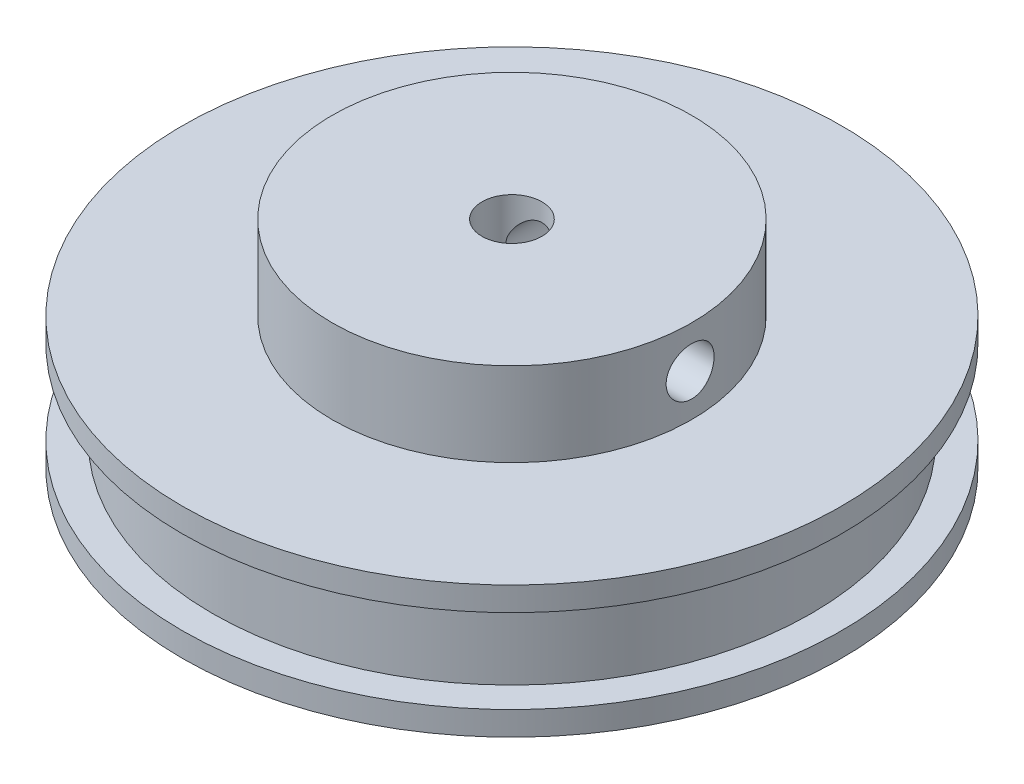
ISO-10303-21;
HEADER;
FILE_DESCRIPTION(('STEP AP214'),'2;1');
FILE_NAME('part.step','',(''),(''),'','','');
FILE_SCHEMA(('AUTOMOTIVE_DESIGN { 1 0 10303 214 1 1 1 1 }'));
ENDSEC;
DATA;
#1=APPLICATION_CONTEXT('core data for automotive mechanical design processes');
#2=APPLICATION_PROTOCOL_DEFINITION('international standard','automotive_design',2000,#1);
#3=PRODUCT_CONTEXT('',#1,'mechanical');
#4=PRODUCT('Part','Part','',(#3));
#5=PRODUCT_RELATED_PRODUCT_CATEGORY('part','',(#4));
#6=PRODUCT_DEFINITION_FORMATION('','',#4);
#7=PRODUCT_DEFINITION_CONTEXT('part definition',#1,'design');
#8=PRODUCT_DEFINITION('design','',#6,#7);
#9=PRODUCT_DEFINITION_SHAPE('','',#8);
#10=(LENGTH_UNIT() NAMED_UNIT(*) SI_UNIT(.MILLI.,.METRE.));
#11=(NAMED_UNIT(*) PLANE_ANGLE_UNIT() SI_UNIT($,.RADIAN.));
#12=(NAMED_UNIT(*) SI_UNIT($,.STERADIAN.) SOLID_ANGLE_UNIT());
#13=UNCERTAINTY_MEASURE_WITH_UNIT(LENGTH_MEASURE(1.E-05),#10,'distance_accuracy_value','');
#14=(GEOMETRIC_REPRESENTATION_CONTEXT(3) GLOBAL_UNCERTAINTY_ASSIGNED_CONTEXT((#13)) GLOBAL_UNIT_ASSIGNED_CONTEXT((#10,
#11,#12)) REPRESENTATION_CONTEXT('',''));
#15=CARTESIAN_POINT('',(0.,0.,0.));
#16=DIRECTION('',(0.,0.,1.));
#17=DIRECTION('',(1.,0.,0.));
#18=AXIS2_PLACEMENT_3D('',#15,#16,#17);
#19=CARTESIAN_POINT('',(0.,2.,0.));
#20=DIRECTION('',(0.,-1.,0.));
#21=DIRECTION('',(0.,0.,-1.));
#22=AXIS2_PLACEMENT_3D('',#19,#20,#21);
#23=CYLINDRICAL_SURFACE('',#22,27.5);
#24=CARTESIAN_POINT('',(0.,2.,0.));
#25=DIRECTION('',(0.,1.,0.));
#26=DIRECTION('',(0.,0.,1.));
#27=AXIS2_PLACEMENT_3D('',#24,#25,#26);
#28=CIRCLE('',#27,27.5);
#29=CARTESIAN_POINT('',(0.,2.,27.5));
#30=VERTEX_POINT('',#29);
#31=EDGE_CURVE('E135',#30,#30,#28,.T.);
#32=ORIENTED_EDGE('',*,*,#31,.F.);
#33=EDGE_LOOP('',(#32));
#34=FACE_BOUND('',#33,.T.);
#35=CARTESIAN_POINT('',(0.,0.,0.));
#36=DIRECTION('',(0.,1.,0.));
#37=DIRECTION('',(0.,0.,1.));
#38=AXIS2_PLACEMENT_3D('',#35,#36,#37);
#39=CIRCLE('',#38,27.5);
#40=CARTESIAN_POINT('',(0.,0.,27.5));
#41=VERTEX_POINT('',#40);
#42=EDGE_CURVE('E76',#41,#41,#39,.T.);
#43=ORIENTED_EDGE('',*,*,#42,.T.);
#44=EDGE_LOOP('',(#43));
#45=FACE_BOUND('',#44,.T.);
#46=ADVANCED_FACE('F37',(#34,#45),#23,.T.);
#47=CARTESIAN_POINT('',(0.,2.,0.));
#48=DIRECTION('',(0.,1.,0.));
#49=DIRECTION('',(0.,0.,1.));
#50=AXIS2_PLACEMENT_3D('',#47,#48,#49);
#51=PLANE('',#50);
#52=CARTESIAN_POINT('',(0.,2.,0.));
#53=DIRECTION('',(0.,1.,0.));
#54=DIRECTION('',(0.,0.,1.));
#55=AXIS2_PLACEMENT_3D('',#52,#53,#54);
#56=CIRCLE('',#55,25.);
#57=CARTESIAN_POINT('',(0.,2.,25.));
#58=VERTEX_POINT('',#57);
#59=EDGE_CURVE('E139',#58,#58,#56,.T.);
#60=ORIENTED_EDGE('',*,*,#59,.F.);
#61=EDGE_LOOP('',(#60));
#62=FACE_BOUND('',#61,.T.);
#63=ORIENTED_EDGE('',*,*,#31,.T.);
#64=EDGE_LOOP('',(#63));
#65=FACE_BOUND('',#64,.T.);
#66=ADVANCED_FACE('F119',(#62,#65),#51,.T.);
#67=CARTESIAN_POINT('',(0.,0.,0.));
#68=DIRECTION('',(0.,1.,0.));
#69=DIRECTION('',(0.,0.,1.));
#70=AXIS2_PLACEMENT_3D('',#67,#68,#69);
#71=PLANE('',#70);
#72=CARTESIAN_POINT('',(0.,0.,0.));
#73=DIRECTION('',(0.,1.,0.));
#74=DIRECTION('',(0.,0.,1.));
#75=AXIS2_PLACEMENT_3D('',#72,#73,#74);
#76=CIRCLE('',#75,2.5);
#77=CARTESIAN_POINT('',(0.,0.,2.5));
#78=VERTEX_POINT('',#77);
#79=EDGE_CURVE('E93',#78,#78,#76,.T.);
#80=ORIENTED_EDGE('',*,*,#79,.T.);
#81=EDGE_LOOP('',(#80));
#82=FACE_BOUND('',#81,.T.);
#83=ORIENTED_EDGE('',*,*,#42,.F.);
#84=EDGE_LOOP('',(#83));
#85=FACE_BOUND('',#84,.T.);
#86=ADVANCED_FACE('F117',(#82,#85),#71,.F.);
#87=CARTESIAN_POINT('',(0.,9.,0.));
#88=DIRECTION('',(0.,-1.,0.));
#89=DIRECTION('',(0.,0.,-1.));
#90=AXIS2_PLACEMENT_3D('',#87,#88,#89);
#91=CYLINDRICAL_SURFACE('',#90,25.);
#92=CARTESIAN_POINT('',(0.,9.,0.));
#93=DIRECTION('',(0.,1.,0.));
#94=DIRECTION('',(0.,0.,1.));
#95=AXIS2_PLACEMENT_3D('',#92,#93,#94);
#96=CIRCLE('',#95,25.);
#97=CARTESIAN_POINT('',(0.,9.,25.));
#98=VERTEX_POINT('',#97);
#99=EDGE_CURVE('E138',#98,#98,#96,.T.);
#100=ORIENTED_EDGE('',*,*,#99,.F.);
#101=EDGE_LOOP('',(#100));
#102=FACE_BOUND('',#101,.T.);
#103=ORIENTED_EDGE('',*,*,#59,.T.);
#104=EDGE_LOOP('',(#103));
#105=FACE_BOUND('',#104,.T.);
#106=ADVANCED_FACE('F113',(#102,#105),#91,.T.);
#107=CARTESIAN_POINT('',(0.,11.,0.));
#108=DIRECTION('',(0.,-1.,0.));
#109=DIRECTION('',(0.,0.,-1.));
#110=AXIS2_PLACEMENT_3D('',#107,#108,#109);
#111=CYLINDRICAL_SURFACE('',#110,27.5);
#112=CARTESIAN_POINT('',(0.,11.,0.));
#113=DIRECTION('',(0.,1.,0.));
#114=DIRECTION('',(0.,0.,1.));
#115=AXIS2_PLACEMENT_3D('',#112,#113,#114);
#116=CIRCLE('',#115,27.5);
#117=CARTESIAN_POINT('',(0.,11.,27.5));
#118=VERTEX_POINT('',#117);
#119=EDGE_CURVE('E141',#118,#118,#116,.T.);
#120=ORIENTED_EDGE('',*,*,#119,.F.);
#121=EDGE_LOOP('',(#120));
#122=FACE_BOUND('',#121,.T.);
#123=CARTESIAN_POINT('',(0.,9.,0.));
#124=DIRECTION('',(0.,1.,0.));
#125=DIRECTION('',(0.,0.,1.));
#126=AXIS2_PLACEMENT_3D('',#123,#124,#125);
#127=CIRCLE('',#126,27.5);
#128=CARTESIAN_POINT('',(0.,9.,27.5));
#129=VERTEX_POINT('',#128);
#130=EDGE_CURVE('E145',#129,#129,#127,.T.);
#131=ORIENTED_EDGE('',*,*,#130,.T.);
#132=EDGE_LOOP('',(#131));
#133=FACE_BOUND('',#132,.T.);
#134=ADVANCED_FACE('F106',(#122,#133),#111,.T.);
#135=CARTESIAN_POINT('',(0.,11.,0.));
#136=DIRECTION('',(0.,1.,0.));
#137=DIRECTION('',(0.,0.,1.));
#138=AXIS2_PLACEMENT_3D('',#135,#136,#137);
#139=PLANE('',#138);
#140=CARTESIAN_POINT('',(0.,11.,0.));
#141=DIRECTION('',(0.,1.,0.));
#142=DIRECTION('',(0.,0.,1.));
#143=AXIS2_PLACEMENT_3D('',#140,#141,#142);
#144=CIRCLE('',#143,15.);
#145=CARTESIAN_POINT('',(0.,11.,15.));
#146=VERTEX_POINT('',#145);
#147=EDGE_CURVE('E44',#146,#146,#144,.T.);
#148=ORIENTED_EDGE('',*,*,#147,.F.);
#149=EDGE_LOOP('',(#148));
#150=FACE_BOUND('',#149,.T.);
#151=ORIENTED_EDGE('',*,*,#119,.T.);
#152=EDGE_LOOP('',(#151));
#153=FACE_BOUND('',#152,.T.);
#154=ADVANCED_FACE('F102',(#150,#153),#139,.T.);
#155=CARTESIAN_POINT('',(0.,9.,0.));
#156=DIRECTION('',(0.,1.,0.));
#157=DIRECTION('',(0.,0.,1.));
#158=AXIS2_PLACEMENT_3D('',#155,#156,#157);
#159=PLANE('',#158);
#160=ORIENTED_EDGE('',*,*,#99,.T.);
#161=EDGE_LOOP('',(#160));
#162=FACE_BOUND('',#161,.T.);
#163=ORIENTED_EDGE('',*,*,#130,.F.);
#164=EDGE_LOOP('',(#163));
#165=FACE_BOUND('',#164,.T.);
#166=ADVANCED_FACE('F100',(#162,#165),#159,.F.);
#167=CARTESIAN_POINT('',(0.,18.,0.));
#168=DIRECTION('',(0.,-1.,0.));
#169=DIRECTION('',(0.,0.,-1.));
#170=AXIS2_PLACEMENT_3D('',#167,#168,#169);
#171=CYLINDRICAL_SURFACE('',#170,15.);
#172=CARTESIAN_POINT('',(14.8660687473185,14.5,2.00000000000005));
#173=CARTESIAN_POINT('',(14.8660704451043,14.6118038554675,1.99999528594764));
#174=CARTESIAN_POINT('',(14.8673436464034,14.7236760331162,1.99059326704133));
#175=CARTESIAN_POINT('',(14.8722964859732,14.9443024623359,1.95323796266135));
#176=CARTESIAN_POINT('',(14.8759785863295,15.0530534049172,1.92526569649118));
#177=CARTESIAN_POINT('',(14.8853249214529,15.2642113682263,1.85161311140269));
#178=CARTESIAN_POINT('',(14.8909877556206,15.3666228116177,1.8059453027505));
#179=CARTESIAN_POINT('',(14.9036558225185,15.5623110757096,1.69822564880692));
#180=CARTESIAN_POINT('',(14.9106608397868,15.655589358938,1.63617643263474));
#181=CARTESIAN_POINT('',(14.9252737732073,15.8309734546685,1.49703370489523));
#182=CARTESIAN_POINT('',(14.9328848849373,15.9130128656794,1.41985682274865));
#183=CARTESIAN_POINT('',(14.9478237625824,16.0630162454564,1.25282922872616));
#184=CARTESIAN_POINT('',(14.9551515139324,16.1309794914762,1.16297786647204));
#185=CARTESIAN_POINT('',(14.9687309976037,16.2511418417164,0.972731724927666));
#186=CARTESIAN_POINT('',(14.9749785650228,16.3032804892902,0.872298437711275));
#187=CARTESIAN_POINT('',(14.9856585341581,16.3899261641808,0.66400381603742));
#188=CARTESIAN_POINT('',(14.990091012146,16.4244339323777,0.556142793922454));
#189=CARTESIAN_POINT('',(14.9966188619561,16.4746389095803,0.336735375014143));
#190=CARTESIAN_POINT('',(14.9987279820508,16.490446815012,0.225214723469952));
#191=CARTESIAN_POINT('',(15.0004184797152,16.5031466087368,0.00108500230371052));
#192=CARTESIAN_POINT('',(14.9999999696283,16.5000393377365,-0.111524018722412));
#193=CARTESIAN_POINT('',(14.9966934411691,16.4750852694591,-0.333880124465715));
#194=CARTESIAN_POINT('',(14.9938211133781,16.4533575352544,-0.44364083736173));
#195=CARTESIAN_POINT('',(14.9859472409229,16.3919656729785,-0.6579441227125));
#196=CARTESIAN_POINT('',(14.9809456511403,16.3523011648319,-0.762486584541785));
#197=CARTESIAN_POINT('',(14.9693481900417,16.2560365588782,-0.963751808424073));
#198=CARTESIAN_POINT('',(14.9627475214588,16.1993853768169,-1.0604498493532));
#199=CARTESIAN_POINT('',(14.9486895041904,16.0707927427171,-1.24301169073473));
#200=CARTESIAN_POINT('',(14.9412321108429,15.9988504933722,-1.32887492586676));
#201=CARTESIAN_POINT('',(14.9262258809566,15.8410521516411,-1.48803006154533));
#202=CARTESIAN_POINT('',(14.918676784244,15.7550922318064,-1.56121903353016));
#203=CARTESIAN_POINT('',(14.9043949876924,15.5720540686274,-1.69214693057186));
#204=CARTESIAN_POINT('',(14.8976622910908,15.474975781197,-1.74988579436348));
#205=CARTESIAN_POINT('',(14.8857757633434,15.2723599996533,-1.84828286086495));
#206=CARTESIAN_POINT('',(14.8806227621479,15.1668180954815,-1.88893208906701));
#207=CARTESIAN_POINT('',(14.8724947546572,14.9503219793616,-1.95190090044919));
#208=CARTESIAN_POINT('',(14.8695196283616,14.8393680659734,-1.97422149354138));
#209=CARTESIAN_POINT('',(14.8661064501035,14.616108664995,-1.99976160768722));
#210=CARTESIAN_POINT('',(14.8656491151163,14.5038200696675,-2.00312631098807));
#211=CARTESIAN_POINT('',(14.867272242967,14.2802807438953,-1.99104288188791));
#212=CARTESIAN_POINT('',(14.8693526440475,14.1690299882606,-1.97559520729771));
#213=CARTESIAN_POINT('',(14.8757992043677,13.9511640135944,-1.92644805037015));
#214=CARTESIAN_POINT('',(14.8801564778765,13.8445325069819,-1.89281950323355));
#215=CARTESIAN_POINT('',(14.8906585901441,13.6384210865476,-1.8083384508012));
#216=CARTESIAN_POINT('',(14.8968034998284,13.5389414566763,-1.75748526209378));
#217=CARTESIAN_POINT('',(14.9102344661952,13.3493026895592,-1.63964406417206));
#218=CARTESIAN_POINT('',(14.9175271378913,13.2592029516318,-1.57256123166295));
#219=CARTESIAN_POINT('',(14.9324114351651,13.0914890615629,-1.42429832312794));
#220=CARTESIAN_POINT('',(14.9400030739993,13.013875463852,-1.34311762143749));
#221=CARTESIAN_POINT('',(14.9546894865533,12.8728234460789,-1.16832754835819));
#222=CARTESIAN_POINT('',(14.9617807004972,12.8094806836284,-1.07464064093247));
#223=CARTESIAN_POINT('',(14.974613414783,12.6994317178247,-0.87787245231757));
#224=CARTESIAN_POINT('',(14.9803549454849,12.6527251402439,-0.774791382513649));
#225=CARTESIAN_POINT('',(14.9898256469115,12.5774307384119,-0.562472772523383));
#226=CARTESIAN_POINT('',(14.9935608482078,12.5487885709165,-0.453254784247312));
#227=CARTESIAN_POINT('',(14.9986231668662,12.510259514539,-0.231506493423148));
#228=CARTESIAN_POINT('',(14.9999504085613,12.5003716572923,-0.118976362199773));
#229=CARTESIAN_POINT('',(15.0000464724842,12.4996517327597,0.105269873711638));
#230=CARTESIAN_POINT('',(14.9988350491343,12.5086725294056,0.21698552592193));
#231=CARTESIAN_POINT('',(14.9940293321986,12.545201041232,0.437297443052403));
#232=CARTESIAN_POINT('',(14.9904350419501,12.5727087305213,0.545893712341097));
#233=CARTESIAN_POINT('',(14.9812655664247,12.6453820470767,0.75685823458891));
#234=CARTESIAN_POINT('',(14.9756912840831,12.6905396264081,0.859229301543961));
#235=CARTESIAN_POINT('',(14.9631774939599,12.7972155496457,1.05496407863093));
#236=CARTESIAN_POINT('',(14.95623796097,12.8587341956524,1.14832762239922));
#237=CARTESIAN_POINT('',(14.9417029120984,12.9969266820036,1.32414728606679));
#238=CARTESIAN_POINT('',(14.9341029029987,13.0737097901392,1.40651715716405));
#239=CARTESIAN_POINT('',(14.919138648968,13.2400230690474,1.55725895587221));
#240=CARTESIAN_POINT('',(14.911774460102,13.3295562439213,1.62562757530237));
#241=CARTESIAN_POINT('',(14.8980810988492,13.5192839415709,1.746687909785));
#242=CARTESIAN_POINT('',(14.8917566176026,13.6195235915101,1.79930940429131));
#243=CARTESIAN_POINT('',(14.8809136658427,13.8274484675171,1.88689518281496));
#244=CARTESIAN_POINT('',(14.8763932602426,13.9351255697594,1.92187839666371));
#245=CARTESIAN_POINT('',(14.8707513382361,14.1194482787255,1.96495480378588));
#246=CARTESIAN_POINT('',(14.8690042861798,14.1949382729681,1.97807748135808));
#247=CARTESIAN_POINT('',(14.866662414787,14.3469415094705,1.99560165343187));
#248=CARTESIAN_POINT('',(14.8660675849485,14.4234547423974,2.00000322742325));
#249=CARTESIAN_POINT('',(14.8660687473185,14.5,2.00000000000005));
#250=B_SPLINE_CURVE_WITH_KNOTS('',3,(#172,#173,#174,#175,#176,#177,#178,#179,#180,#181,#182,
#183,#184,#185,#186,#187,#188,#189,#190,#191,#192,#193,#194,#195,#196,#197,#198,#199,#200,#201,
#202,#203,#204,#205,#206,#207,#208,#209,#210,#211,#212,#213,#214,#215,#216,#217,#218,#219,#220,
#221,#222,#223,#224,#225,#226,#227,#228,#229,#230,#231,#232,#233,#234,#235,#236,#237,#238,#239,
#240,#241,#242,#243,#244,#245,#246,#247,#248,#249),.UNSPECIFIED.,.T.,.F.,(4,2,2,2,2,2,2,2,2,2,2,
2,2,2,2,2,2,2,2,2,2,2,2,2,2,2,2,2,2,2,2,2,2,2,2,2,2,2,4),(0.,0.335131889250449,
0.670606846105682,1.00584506276825,1.34102950834956,1.67811595121165,2.01521969762238,
2.35359556525146,2.69195721256928,3.02830569524968,3.36463922864856,3.69883808669952,
4.03304402666678,4.36826528456251,4.70350402584628,5.04134915068958,5.3791956151909,
5.7172192765574,6.05522431149101,6.3906370258193,6.72604157783542,7.06014684818595,
7.39426537618209,7.73038528142332,8.06652010750621,8.40484511764504,8.74316251675152,
9.08045723770335,9.41773454222147,9.752397098563,10.0870591862064,10.4215688535019,
10.7560846978108,11.0930874236894,11.430169684094,11.768733419821,12.1069330231324,
12.3363794094425,12.5658237044201),.UNSPECIFIED.);
#251=CARTESIAN_POINT('',(14.8660687473185,14.5,2.00000000000005));
#252=VERTEX_POINT('',#251);
#253=EDGE_CURVE('E60',#252,#252,#250,.T.);
#254=ORIENTED_EDGE('',*,*,#253,.T.);
#255=EDGE_LOOP('',(#254));
#256=FACE_BOUND('',#255,.T.);
#257=CARTESIAN_POINT('',(0.,16.5,-15.));
#258=CARTESIAN_POINT('',(-0.111808835669284,16.4999952902931,-14.9999983574254));
#259=CARTESIAN_POINT('',(-0.22368597927628,16.4905924620375,-14.9987367072719));
#260=CARTESIAN_POINT('',(-0.444322725138079,16.4532336509504,-14.993825111269));
#261=CARTESIAN_POINT('',(-0.553079022333037,16.4252587051029,-14.9901727244172));
#262=CARTESIAN_POINT('',(-0.764248312626985,16.3515982824586,-14.9808907984907));
#263=CARTESIAN_POINT('',(-0.866665683058495,16.3059251889616,-14.9752626421097));
#264=CARTESIAN_POINT('',(-1.0623638950303,16.1981930861937,-14.9626538666039));
#265=CARTESIAN_POINT('',(-1.15564620633703,16.1361367188335,-14.9556734655857));
#266=CARTESIAN_POINT('',(-1.33102582250468,15.9969867383958,-14.9410899478996));
#267=CARTESIAN_POINT('',(-1.41305798549586,15.9198113549915,-14.9334835816211));
#268=CARTESIAN_POINT('',(-1.56304735673102,15.7527898109233,-14.9185313755795));
#269=CARTESIAN_POINT('',(-1.63100381997221,15.6629429800042,-14.9111855496234));
#270=CARTESIAN_POINT('',(-1.75115902268907,15.472700877055,-14.8975543544019));
#271=CARTESIAN_POINT('',(-1.80329607482578,15.3722663175214,-14.8912731776576));
#272=CARTESIAN_POINT('',(-1.8899384500729,15.1639689327632,-14.8805258737923));
#273=CARTESIAN_POINT('',(-1.92444453245278,15.0561064276467,-14.8760596685121));
#274=CARTESIAN_POINT('',(-1.97464606772174,14.8366941894983,-14.8694793656867));
#275=CARTESIAN_POINT('',(-1.99045204228506,14.7251701654671,-14.8673514537014));
#276=CARTESIAN_POINT('',(-2.00314680548117,14.501033820394,-14.8656465160931));
#277=CARTESIAN_POINT('',(-2.00003645633601,14.3884215491891,-14.866069374204));
#278=CARTESIAN_POINT('',(-1.97507745939234,14.1660788699721,-14.8694055577299));
#279=CARTESIAN_POINT('',(-1.95335097531762,14.0563344701143,-14.8723026462234));
#280=CARTESIAN_POINT('',(-1.89196724634371,13.8420631632399,-14.8802355277475));
#281=CARTESIAN_POINT('',(-1.85230959261457,13.737536375245,-14.8852713695413));
#282=CARTESIAN_POINT('',(-1.75605929143191,13.5362903652928,-14.8969326111103));
#283=CARTESIAN_POINT('',(-1.69941397913749,13.4395966288057,-14.903562941239));
#284=CARTESIAN_POINT('',(-1.57083393344289,13.2570409180823,-14.9176623621993));
#285=CARTESIAN_POINT('',(-1.49889840502385,13.1711795074458,-14.9251314966353));
#286=CARTESIAN_POINT('',(-1.34110490026362,13.0120169874181,-14.9401389923359));
#287=CARTESIAN_POINT('',(-1.25514170702645,12.9388201572977,-14.947677435412));
#288=CARTESIAN_POINT('',(-1.07209417013341,12.8078779550716,-14.9619192381826));
#289=CARTESIAN_POINT('',(-0.975009794442368,12.7501326274765,-14.9686225954715));
#290=CARTESIAN_POINT('',(-0.772392219730468,12.6517308823053,-14.9804439374358));
#291=CARTESIAN_POINT('',(-0.666855578841229,12.6110814689537,-14.9855612720896));
#292=CARTESIAN_POINT('',(-0.450370924336247,12.5481106810277,-14.9936282590407));
#293=CARTESIAN_POINT('',(-0.339423199542255,12.5257883293606,-14.9965780268993));
#294=CARTESIAN_POINT('',(-0.116166903325642,12.5002415672289,-14.9999624137686));
#295=CARTESIAN_POINT('',(-0.00387503454704105,12.4968735982165,-15.0004159384905));
#296=CARTESIAN_POINT('',(0.219671617218719,12.5089516641272,-14.9988079153852));
#297=CARTESIAN_POINT('',(0.330926425345666,12.5243972417824,-14.996746428686));
#298=CARTESIAN_POINT('',(0.548813715572939,12.573544653384,-14.990351753581));
#299=CARTESIAN_POINT('',(0.655462016512046,12.6071775683222,-14.9860271430292));
#300=CARTESIAN_POINT('',(0.86160509879356,12.6916729659371,-14.9755900925429));
#301=CARTESIAN_POINT('',(0.961099607015639,12.7425361060133,-14.9694775843944));
#302=CARTESIAN_POINT('',(1.15074887861608,12.8603921555833,-14.9560983737007));
#303=CARTESIAN_POINT('',(1.2408458143966,12.9274773657133,-14.9488251504572));
#304=CARTESIAN_POINT('',(1.4085529469919,13.0757433292243,-14.9339572870998));
#305=CARTESIAN_POINT('',(1.48616257662379,13.1569247225164,-14.9263626324062));
#306=CARTESIAN_POINT('',(1.62720549423098,13.3317131426396,-14.9116490247351));
#307=CARTESIAN_POINT('',(1.69054327608938,13.4253975667382,-14.904533487753));
#308=CARTESIAN_POINT('',(1.80058351078814,13.6221594102809,-14.8916413300182));
#309=CARTESIAN_POINT('',(1.84728633510347,13.7252366199104,-14.8858646793678));
#310=CARTESIAN_POINT('',(1.92257836500746,13.9375572420277,-14.8763281178008));
#311=CARTESIAN_POINT('',(1.95122028846796,14.0467816852108,-14.872562342326));
#312=CARTESIAN_POINT('',(1.98974667143959,14.2685436321288,-14.8674574869829));
#313=CARTESIAN_POINT('',(1.99963213426782,14.3810809583244,-14.8661182773134));
#314=CARTESIAN_POINT('',(2.00034485806189,14.6053234908535,-14.8660223129545));
#315=CARTESIAN_POINT('',(1.99132219194493,14.7170282409642,-14.8672452228252));
#316=CARTESIAN_POINT('',(1.95479376686689,14.9373178751039,-14.872091838742));
#317=CARTESIAN_POINT('',(1.92728801483269,15.045902760302,-14.8757155438883));
#318=CARTESIAN_POINT('',(1.85462310332207,15.2568436832516,-14.8849489027276));
#319=CARTESIAN_POINT('',(1.80947220819041,15.3592026111169,-14.890557626594));
#320=CARTESIAN_POINT('',(1.70281342759737,15.5549158838261,-14.9031304571282));
#321=CARTESIAN_POINT('',(1.64130522630428,15.648270054756,-14.910094589966));
#322=CARTESIAN_POINT('',(1.50312448509508,15.8240896499284,-14.9246596718306));
#323=CARTESIAN_POINT('',(1.42634027226901,15.9064669477551,-14.9322650575408));
#324=CARTESIAN_POINT('',(1.26002169349824,16.0572232163615,-14.9472171900166));
#325=CARTESIAN_POINT('',(1.17048434072978,16.1255988987503,-14.9545638756898));
#326=CARTESIAN_POINT('',(0.980752987852822,16.2466671384665,-14.9682063513753));
#327=CARTESIAN_POINT('',(0.880514620743964,16.2992906665552,-14.9744974642689));
#328=CARTESIAN_POINT('',(0.672592409587328,16.3868805985451,-14.9852732065897));
#329=CARTESIAN_POINT('',(0.564916678969889,16.4218659086249,-14.9897597692431));
#330=CARTESIAN_POINT('',(0.380588408098418,16.4649480063852,-14.9953572174327));
#331=CARTESIAN_POINT('',(0.305091081955778,16.4780732435236,-14.9970896363507));
#332=CARTESIAN_POINT('',(0.153073171616111,16.4956008141655,-14.9994115849077));
#333=CARTESIAN_POINT('',(0.0765525964512399,16.5000032246136,-15.000001124628));
#334=CARTESIAN_POINT('',(0.,16.5,-15.));
#335=B_SPLINE_CURVE_WITH_KNOTS('',3,(#257,#258,#259,#260,#261,#262,#263,#264,#265,#266,#267,
#268,#269,#270,#271,#272,#273,#274,#275,#276,#277,#278,#279,#280,#281,#282,#283,#284,#285,#286,
#287,#288,#289,#290,#291,#292,#293,#294,#295,#296,#297,#298,#299,#300,#301,#302,#303,#304,#305,
#306,#307,#308,#309,#310,#311,#312,#313,#314,#315,#316,#317,#318,#319,#320,#321,#322,#323,#324,
#325,#326,#327,#328,#329,#330,#331,#332,#333,#334),.UNSPECIFIED.,.T.,.F.,(4,2,2,2,2,2,2,2,2,2,2,
2,2,2,2,2,2,2,2,2,2,2,2,2,2,2,2,2,2,2,2,2,2,2,2,2,2,2,4),(0.,0.335146851305744,
0.670636430885045,1.00589169282741,1.34109292564035,1.67815978443559,2.01524447904836,
2.35362721511648,2.69199537766205,3.02835355914359,3.3646964092492,3.69884885098044,
4.03300891175851,4.36821583137898,4.70344018443797,5.04130544484849,5.37917167852296,
5.71717620202539,6.05516270391743,6.39058584992061,6.72600084354478,7.06015363396463,
7.39431917503546,7.73043274769884,8.06656158258761,8.4048770453545,8.74318495273048,
9.08050074735454,9.41779849783634,9.75242927496624,10.0870599266874,10.4215340370262,
10.756014605959,11.0930366783511,11.4301378125116,11.7686952667452,12.1068890499242,
12.3363573904731,12.5658237068544),.UNSPECIFIED.);
#336=CARTESIAN_POINT('',(0.,16.5,-15.));
#337=VERTEX_POINT('',#336);
#338=EDGE_CURVE('E64',#337,#337,#335,.T.);
#339=ORIENTED_EDGE('',*,*,#338,.T.);
#340=EDGE_LOOP('',(#339));
#341=FACE_BOUND('',#340,.T.);
#342=CARTESIAN_POINT('',(0.,18.,0.));
#343=DIRECTION('',(0.,1.,0.));
#344=DIRECTION('',(0.,0.,1.));
#345=AXIS2_PLACEMENT_3D('',#342,#343,#344);
#346=CIRCLE('',#345,15.);
#347=CARTESIAN_POINT('',(0.,18.,15.));
#348=VERTEX_POINT('',#347);
#349=EDGE_CURVE('E157',#348,#348,#346,.T.);
#350=ORIENTED_EDGE('',*,*,#349,.F.);
#351=EDGE_LOOP('',(#350));
#352=FACE_BOUND('',#351,.T.);
#353=ORIENTED_EDGE('',*,*,#147,.T.);
#354=EDGE_LOOP('',(#353));
#355=FACE_BOUND('',#354,.T.);
#356=ADVANCED_FACE('F95',(#256,#341,#352,#355),#171,.T.);
#357=CARTESIAN_POINT('',(0.,18.,0.));
#358=DIRECTION('',(0.,1.,0.));
#359=DIRECTION('',(0.,0.,1.));
#360=AXIS2_PLACEMENT_3D('',#357,#358,#359);
#361=PLANE('',#360);
#362=CARTESIAN_POINT('',(0.,18.,0.));
#363=DIRECTION('',(0.,1.,0.));
#364=DIRECTION('',(0.,0.,1.));
#365=AXIS2_PLACEMENT_3D('',#362,#363,#364);
#366=CIRCLE('',#365,2.5);
#367=CARTESIAN_POINT('',(0.,18.,2.5));
#368=VERTEX_POINT('',#367);
#369=EDGE_CURVE('E66',#368,#368,#366,.T.);
#370=ORIENTED_EDGE('',*,*,#369,.F.);
#371=EDGE_LOOP('',(#370));
#372=FACE_BOUND('',#371,.T.);
#373=ORIENTED_EDGE('',*,*,#349,.T.);
#374=EDGE_LOOP('',(#373));
#375=FACE_BOUND('',#374,.T.);
#376=ADVANCED_FACE('F99',(#372,#375),#361,.T.);
#377=CARTESIAN_POINT('',(0.,0.,0.));
#378=DIRECTION('',(0.,1.,0.));
#379=DIRECTION('',(0.,0.,1.));
#380=AXIS2_PLACEMENT_3D('',#377,#378,#379);
#381=CYLINDRICAL_SURFACE('',#380,2.5);
#382=CARTESIAN_POINT('',(2.,14.5,-1.5));
#383=CARTESIAN_POINT('',(1.9999899563842,14.4249189826114,-1.5000227575991));
#384=CARTESIAN_POINT('',(1.99572243014959,14.3497210739064,-1.50575588676017));
#385=CARTESIAN_POINT('',(1.97904350434638,14.2016854705704,-1.52759797098302));
#386=CARTESIAN_POINT('',(1.96660415938922,14.1288567781879,-1.54374252679463));
#387=CARTESIAN_POINT('',(1.9288828901246,13.9623945804915,-1.59078313764401));
#388=CARTESIAN_POINT('',(1.90063587852784,13.8703574929005,-1.62485949442395));
#389=CARTESIAN_POINT('',(1.83286412912235,13.6940318598387,-1.70094533012843));
#390=CARTESIAN_POINT('',(1.79330760683741,13.6097660503329,-1.74297705283045));
#391=CARTESIAN_POINT('',(1.68777756612173,13.4196603432195,-1.84624966659378));
#392=CARTESIAN_POINT('',(1.61742363711761,13.3170334258727,-1.90894188114929));
#393=CARTESIAN_POINT('',(1.4586193506474,13.1260231647878,-2.03287996747903));
#394=CARTESIAN_POINT('',(1.37018407682201,13.0376280578861,-2.0941269976447));
#395=CARTESIAN_POINT('',(1.19476026278806,12.8928950804225,-2.1979067439451));
#396=CARTESIAN_POINT('',(1.11093376146689,12.8336737173159,-2.24174680788007));
#397=CARTESIAN_POINT('',(0.932444755507564,12.7276340400337,-2.32165152523267));
#398=CARTESIAN_POINT('',(0.837799422094952,12.6807964517991,-2.35772824500368));
#399=CARTESIAN_POINT('',(0.655317082222549,12.6082870394193,-2.41415644696378));
#400=CARTESIAN_POINT('',(0.568853585755696,12.5804174354239,-2.43610736091393));
#401=CARTESIAN_POINT('',(0.391188052921992,12.536501304746,-2.47085912284979));
#402=CARTESIAN_POINT('',(0.299988637312623,12.52044831209,-2.48366497483986));
#403=CARTESIAN_POINT('',(0.115048335136528,12.5011419067099,-2.49907968883617));
#404=CARTESIAN_POINT('',(0.0212997713727013,12.4979328073114,-2.50165324772141));
#405=CARTESIAN_POINT('',(-0.165416366428141,12.5046642348722,-2.49626936144757));
#406=CARTESIAN_POINT('',(-0.258383904122233,12.5146053703685,-2.48831142893578));
#407=CARTESIAN_POINT('',(-0.435683568436098,12.546067986313,-2.4632836571348));
#408=CARTESIAN_POINT('',(-0.520210188917499,12.5669288169561,-2.44673404857181));
#409=CARTESIAN_POINT('',(-0.684171862172426,12.6186952342522,-2.40604493660584));
#410=CARTESIAN_POINT('',(-0.76360562412977,12.6496033554976,-2.38190351809567));
#411=CARTESIAN_POINT('',(-0.923527318234433,12.7236006985885,-2.32486221996811));
#412=CARTESIAN_POINT('',(-1.00337969293305,12.7675765160147,-2.29134265660255));
#413=CARTESIAN_POINT('',(-1.15470891362336,12.8645378595917,-2.21894043646479));
#414=CARTESIAN_POINT('',(-1.22618103296473,12.9175284293631,-2.18005477975512));
#415=CARTESIAN_POINT('',(-1.37426521356107,13.0430618687988,-2.09053510980241));
#416=CARTESIAN_POINT('',(-1.44890108738507,13.1173836142049,-2.03913144290366));
#417=CARTESIAN_POINT('',(-1.58538384993671,13.2762559036507,-1.9349237792571));
#418=CARTESIAN_POINT('',(-1.6472149443604,13.3608188786743,-1.88211814269102));
#419=CARTESIAN_POINT('',(-1.75228528490804,13.5312201958179,-1.78441317626436));
#420=CARTESIAN_POINT('',(-1.79674173995946,13.6161509405137,-1.73924224553799));
#421=CARTESIAN_POINT('',(-1.87389106987978,13.7943664663345,-1.65582105773209));
#422=CARTESIAN_POINT('',(-1.90660965872838,13.8876324203376,-1.61755576516689));
#423=CARTESIAN_POINT('',(-1.95062199735974,14.0527916040278,-1.56393805143324));
#424=CARTESIAN_POINT('',(-1.96540293714784,14.1226128308979,-1.54515601955456));
#425=CARTESIAN_POINT('',(-1.98746978122375,14.2651802059542,-1.51667304681101));
#426=CARTESIAN_POINT('',(-1.99477239579985,14.3379194539107,-1.50695186390373));
#427=CARTESIAN_POINT('',(-2.0012999442642,14.4848633779274,-1.49827790293909));
#428=CARTESIAN_POINT('',(-2.00047806264257,14.5590740850574,-1.49938753445573));
#429=CARTESIAN_POINT('',(-1.99072610261057,14.7060473250374,-1.51230456185753));
#430=CARTESIAN_POINT('',(-1.98178458332099,14.7788076663875,-1.52412705251965));
#431=CARTESIAN_POINT('',(-1.95331430449204,14.9390632026618,-1.56051508430773));
#432=CARTESIAN_POINT('',(-1.9316709289088,15.0255982681308,-1.58755721486228));
#433=CARTESIAN_POINT('',(-1.87841388450525,15.1922908660855,-1.65022809339808));
#434=CARTESIAN_POINT('',(-1.84677049067316,15.2724284809031,-1.6858823654909));
#435=CARTESIAN_POINT('',(-1.75807608919816,15.4615289293493,-1.77903249993889));
#436=CARTESIAN_POINT('',(-1.69602510944931,15.5668953343252,-1.83905564347523));
#437=CARTESIAN_POINT('',(-1.55438039564658,15.764384149242,-1.96026853157683));
#438=CARTESIAN_POINT('',(-1.47476601547363,15.8564907596835,-2.02145957104429));
#439=CARTESIAN_POINT('',(-1.29702304107542,16.027462807345,-2.13993299259157));
#440=CARTESIAN_POINT('',(-1.19864860522964,16.1061226291131,-2.1971478825966));
#441=CARTESIAN_POINT('',(-0.984970277741333,16.2452665274442,-2.30083046289374));
#442=CARTESIAN_POINT('',(-0.869723203455205,16.3058096056706,-2.3473329244064));
#443=CARTESIAN_POINT('',(-0.664531994140986,16.3884905874669,-2.41163161860482));
#444=CARTESIAN_POINT('',(-0.578408265123348,16.4167173769741,-2.43384921549885));
#445=CARTESIAN_POINT('',(-0.401365381235645,16.461432134964,-2.46921550391513));
#446=CARTESIAN_POINT('',(-0.310449944179072,16.4779290645406,-2.48237111815072));
#447=CARTESIAN_POINT('',(-0.125961358052316,16.4981928241047,-2.49854699723994));
#448=CARTESIAN_POINT('',(-0.0323797561454615,16.5019132050583,-2.50153028039159));
#449=CARTESIAN_POINT('',(0.154129494971543,16.4962334907348,-2.49698719993361));
#450=CARTESIAN_POINT('',(0.247057097671178,16.4868324715917,-2.48946009629711));
#451=CARTESIAN_POINT('',(0.424484983307836,16.4563964529088,-2.46524008405095));
#452=CARTESIAN_POINT('',(0.509170159101607,16.4360106685972,-2.44905900306101));
#453=CARTESIAN_POINT('',(0.673520542356737,16.3851465786865,-2.40905201963011));
#454=CARTESIAN_POINT('',(0.753184443303519,16.354665659174,-2.3852241372675));
#455=CARTESIAN_POINT('',(0.913383591851862,16.2816254556074,-2.32886203207214));
#456=CARTESIAN_POINT('',(0.993310088153965,16.238206157889,-2.29572397002092));
#457=CARTESIAN_POINT('',(1.14486396126305,16.1423576629054,-2.22403396009593));
#458=CARTESIAN_POINT('',(1.21648689776308,16.0899236819315,-2.18547913977516));
#459=CARTESIAN_POINT('',(1.36488223995397,15.9657037869963,-2.0966685242987));
#460=CARTESIAN_POINT('',(1.4397080379364,15.8921535866846,-2.04563299169993));
#461=CARTESIAN_POINT('',(1.5766935307999,15.7348830744766,-1.9420131292006));
#462=CARTESIAN_POINT('',(1.63883728583053,15.6511501723947,-1.88942694411834));
#463=CARTESIAN_POINT('',(1.7455126136634,15.4810424554704,-1.79109125321811));
#464=CARTESIAN_POINT('',(1.79106140064658,15.3954274787839,-1.74513263017548));
#465=CARTESIAN_POINT('',(1.87016304685231,15.2156081117486,-1.66007449903139));
#466=CARTESIAN_POINT('',(1.90373836359645,15.1214202219623,-1.62096222081731));
#467=CARTESIAN_POINT('',(1.94914139922438,14.9538606732473,-1.56580101941138));
#468=CARTESIAN_POINT('',(1.96446470848963,14.8825804555928,-1.54635220628734));
#469=CARTESIAN_POINT('',(1.98726282623961,14.7369757290291,-1.51695472225641));
#470=CARTESIAN_POINT('',(1.99476751139893,14.6626639447221,-1.50696990066826));
#471=CARTESIAN_POINT('',(1.99935742227831,14.5586747856577,-1.50085460132402));
#472=CARTESIAN_POINT('',(2.00000392566845,14.5293463217565,-1.49999110491774));
#473=CARTESIAN_POINT('',(2.,14.5,-1.5));
#474=B_SPLINE_CURVE_WITH_KNOTS('',3,(#382,#383,#384,#385,#386,#387,#388,#389,#390,#391,#392,
#393,#394,#395,#396,#397,#398,#399,#400,#401,#402,#403,#404,#405,#406,#407,#408,#409,#410,#411,
#412,#413,#414,#415,#416,#417,#418,#419,#420,#421,#422,#423,#424,#425,#426,#427,#428,#429,#430,
#431,#432,#433,#434,#435,#436,#437,#438,#439,#440,#441,#442,#443,#444,#445,#446,#447,#448,#449,
#450,#451,#452,#453,#454,#455,#456,#457,#458,#459,#460,#461,#462,#463,#464,#465,#466,#467,#468,
#469,#470,#471,#472,#473),.UNSPECIFIED.,.T.,.F.,(4,2,2,2,2,2,2,2,2,2,2,2,2,2,2,2,2,2,2,2,2,2,2,
2,2,2,2,2,2,2,2,2,2,2,2,2,2,2,2,2,2,2,2,2,2,4),(0.,0.225140818813289,0.451055593895016,
0.755714384660878,1.06123795594964,1.47720804611674,1.89283253536879,2.22639303179097,
2.55943127851024,2.83862094435178,3.11765772560939,3.39765639927928,3.67766803055209,
3.94241917501297,4.20723715914625,4.49756510688428,4.78805602626152,5.13841226546404,
5.48919811771067,5.80619193384967,6.12248701337037,6.34307726284837,6.56317352160417,
6.78453876949455,7.00621641426758,7.28428560377194,7.56318925297413,7.96975811975666,
8.37680748728569,8.78961174948152,9.20105660259843,9.4798592761315,9.75844872724252,
10.0380499218877,10.3176708039936,10.5823344198312,10.8470666181456,11.1364335884202,
11.4259545900794,11.7747351905783,12.1239515037794,12.4449574092071,12.7653580273015,
12.9909138326702,13.2156045429056,13.3036035490356),.UNSPECIFIED.);
#475=CARTESIAN_POINT('',(1.76776695296638,13.5645856533065,-1.76776695296636));
#476=VERTEX_POINT('',#475);
#477=CARTESIAN_POINT('',(1.76776695296637,15.4354143466935,-1.76776695296636));
#478=VERTEX_POINT('',#477);
#479=EDGE_CURVE('E59',#476,#478,#474,.T.);
#480=ORIENTED_EDGE('',*,*,#479,.T.);
#481=CARTESIAN_POINT('',(1.49999999999999,14.5,2.00000000000001));
#482=CARTESIAN_POINT('',(1.5000227575991,14.4249189826114,1.9999899563842));
#483=CARTESIAN_POINT('',(1.50575588676016,14.3497210739064,1.99572243014959));
#484=CARTESIAN_POINT('',(1.52759797098301,14.2016854705704,1.97904350434639));
#485=CARTESIAN_POINT('',(1.54374252679463,14.1288567781879,1.96660415938923));
#486=CARTESIAN_POINT('',(1.590783137644,13.9623945804915,1.9288828901246));
#487=CARTESIAN_POINT('',(1.62485949442394,13.8703574929005,1.90063587852784));
#488=CARTESIAN_POINT('',(1.70094533012842,13.6940318598387,1.83286412912235));
#489=CARTESIAN_POINT('',(1.74297705283045,13.6097660503329,1.79330760683741));
#490=CARTESIAN_POINT('',(1.84624966659378,13.4196603432195,1.68777756612173));
#491=CARTESIAN_POINT('',(1.90894188114929,13.3170334258727,1.61742363711761));
#492=CARTESIAN_POINT('',(2.03287996747903,13.1260231647878,1.4586193506474));
#493=CARTESIAN_POINT('',(2.0941269976447,13.0376280578861,1.37018407682201));
#494=CARTESIAN_POINT('',(2.1979067439451,12.8928950804225,1.19476026278807));
#495=CARTESIAN_POINT('',(2.24174680788007,12.8336737173159,1.1109337614669));
#496=CARTESIAN_POINT('',(2.32165152523267,12.7276340400337,0.932444755507568));
#497=CARTESIAN_POINT('',(2.35772824500367,12.6807964517991,0.837799422094956));
#498=CARTESIAN_POINT('',(2.41415644696378,12.6082870394193,0.655317082222554));
#499=CARTESIAN_POINT('',(2.43610736091393,12.5804174354239,0.5688535857557));
#500=CARTESIAN_POINT('',(2.47085912284979,12.536501304746,0.391188052921996));
#501=CARTESIAN_POINT('',(2.48366497483986,12.52044831209,0.299988637312628));
#502=CARTESIAN_POINT('',(2.49907968883617,12.5011419067099,0.115048335136534));
#503=CARTESIAN_POINT('',(2.50165324772141,12.4979328073114,0.0212997713727076));
#504=CARTESIAN_POINT('',(2.49626936144757,12.5046642348722,-0.165416366428134));
#505=CARTESIAN_POINT('',(2.48831142893578,12.5146053703685,-0.258383904122225));
#506=CARTESIAN_POINT('',(2.4632836571348,12.546067986313,-0.43568356843609));
#507=CARTESIAN_POINT('',(2.44673404857181,12.5669288169561,-0.520210188917491));
#508=CARTESIAN_POINT('',(2.40604493660584,12.6186952342522,-0.684171862172418));
#509=CARTESIAN_POINT('',(2.38190351809567,12.6496033554976,-0.763605624129762));
#510=CARTESIAN_POINT('',(2.32486221996811,12.7236006985885,-0.923527318234425));
#511=CARTESIAN_POINT('',(2.29134265660256,12.7675765160147,-1.00337969293304));
#512=CARTESIAN_POINT('',(2.2189404364648,12.8645378595917,-1.15470891362335));
#513=CARTESIAN_POINT('',(2.18005477975512,12.9175284293631,-1.22618103296472));
#514=CARTESIAN_POINT('',(2.09053510980242,13.0430618687988,-1.37426521356106));
#515=CARTESIAN_POINT('',(2.03913144290367,13.1173836142049,-1.44890108738506));
#516=CARTESIAN_POINT('',(1.93492377925711,13.2762559036507,-1.58538384993671));
#517=CARTESIAN_POINT('',(1.88211814269103,13.3608188786743,-1.6472149443604));
#518=CARTESIAN_POINT('',(1.78441317626437,13.5312201958179,-1.75228528490804));
#519=CARTESIAN_POINT('',(1.739242245538,13.6161509405137,-1.79674173995945));
#520=CARTESIAN_POINT('',(1.65582105773209,13.7943664663345,-1.87389106987978));
#521=CARTESIAN_POINT('',(1.6175557651669,13.8876324203376,-1.90660965872837));
#522=CARTESIAN_POINT('',(1.56393805143325,14.0527916040278,-1.95062199735974));
#523=CARTESIAN_POINT('',(1.54515601955457,14.1226128308979,-1.96540293714783));
#524=CARTESIAN_POINT('',(1.51667304681102,14.2651802059542,-1.98746978122375));
#525=CARTESIAN_POINT('',(1.50695186390374,14.3379194539107,-1.99477239579984));
#526=CARTESIAN_POINT('',(1.4982779029391,14.4848633779274,-2.0012999442642));
#527=CARTESIAN_POINT('',(1.49938753445574,14.5590740850574,-2.00047806264257));
#528=CARTESIAN_POINT('',(1.51230456185753,14.7060473250374,-1.99072610261057));
#529=CARTESIAN_POINT('',(1.52412705251966,14.7788076663875,-1.98178458332098));
#530=CARTESIAN_POINT('',(1.56051508430774,14.9390632026618,-1.95331430449203));
#531=CARTESIAN_POINT('',(1.58755721486229,15.0255982681308,-1.9316709289088));
#532=CARTESIAN_POINT('',(1.65022809339808,15.1922908660855,-1.87841388450525));
#533=CARTESIAN_POINT('',(1.6858823654909,15.2724284809031,-1.84677049067316));
#534=CARTESIAN_POINT('',(1.7790324999389,15.4615289293493,-1.75807608919815));
#535=CARTESIAN_POINT('',(1.83905564347524,15.5668953343252,-1.6960251094493));
#536=CARTESIAN_POINT('',(1.96026853157684,15.764384149242,-1.55438039564657));
#537=CARTESIAN_POINT('',(2.0214595710443,15.8564907596835,-1.47476601547361));
#538=CARTESIAN_POINT('',(2.13993299259158,16.027462807345,-1.29702304107541));
#539=CARTESIAN_POINT('',(2.19714788259661,16.1061226291131,-1.19864860522963));
#540=CARTESIAN_POINT('',(2.30083046289375,16.2452665274442,-0.984970277741318));
#541=CARTESIAN_POINT('',(2.34733292440641,16.3058096056706,-0.86972320345519));
#542=CARTESIAN_POINT('',(2.41163161860483,16.3884905874669,-0.664531994140972));
#543=CARTESIAN_POINT('',(2.43384921549886,16.4167173769741,-0.578408265123334));
#544=CARTESIAN_POINT('',(2.46921550391513,16.461432134964,-0.401365381235631));
#545=CARTESIAN_POINT('',(2.48237111815073,16.4779290645406,-0.310449944179059));
#546=CARTESIAN_POINT('',(2.49854699723995,16.4981928241047,-0.125961358052302));
#547=CARTESIAN_POINT('',(2.50153028039159,16.5019132050583,-0.0323797561454474));
#548=CARTESIAN_POINT('',(2.4969871999336,16.4962334907348,0.154129494971556));
#549=CARTESIAN_POINT('',(2.48946009629711,16.4868324715917,0.247057097671191));
#550=CARTESIAN_POINT('',(2.46524008405095,16.4563964529088,0.424484983307848));
#551=CARTESIAN_POINT('',(2.449059003061,16.4360106685972,0.509170159101619));
#552=CARTESIAN_POINT('',(2.4090520196301,16.3851465786865,0.673520542356749));
#553=CARTESIAN_POINT('',(2.38522413726749,16.354665659174,0.753184443303531));
#554=CARTESIAN_POINT('',(2.32886203207213,16.2816254556074,0.913383591851871));
#555=CARTESIAN_POINT('',(2.29572397002092,16.238206157889,0.993310088153974));
#556=CARTESIAN_POINT('',(2.22403396009593,16.1423576629054,1.14486396126305));
#557=CARTESIAN_POINT('',(2.18547913977516,16.0899236819315,1.21648689776308));
#558=CARTESIAN_POINT('',(2.0966685242987,15.9657037869963,1.36488223995398));
#559=CARTESIAN_POINT('',(2.04563299169992,15.8921535866846,1.43970803793641));
#560=CARTESIAN_POINT('',(1.94201312920059,15.7348830744766,1.57669353079991));
#561=CARTESIAN_POINT('',(1.88942694411833,15.6511501723947,1.63883728583054));
#562=CARTESIAN_POINT('',(1.79109125321811,15.4810424554704,1.74551261366341));
#563=CARTESIAN_POINT('',(1.74513263017547,15.3954274787839,1.79106140064659));
#564=CARTESIAN_POINT('',(1.66007449903138,15.2156081117486,1.87016304685231));
#565=CARTESIAN_POINT('',(1.6209622208173,15.1214202219623,1.90373836359645));
#566=CARTESIAN_POINT('',(1.56580101941137,14.9538606732473,1.94914139922439));
#567=CARTESIAN_POINT('',(1.54635220628733,14.8825804555928,1.96446470848964));
#568=CARTESIAN_POINT('',(1.5169547222564,14.7369757290291,1.98726282623962));
#569=CARTESIAN_POINT('',(1.50696990066825,14.6626639447221,1.99476751139894));
#570=CARTESIAN_POINT('',(1.50085460132401,14.5586747856577,1.99935742227831));
#571=CARTESIAN_POINT('',(1.49999110491774,14.5293463217565,2.00000392566845));
#572=CARTESIAN_POINT('',(1.49999999999999,14.5,2.00000000000001));
#573=B_SPLINE_CURVE_WITH_KNOTS('',3,(#481,#482,#483,#484,#485,#486,#487,#488,#489,#490,#491,
#492,#493,#494,#495,#496,#497,#498,#499,#500,#501,#502,#503,#504,#505,#506,#507,#508,#509,#510,
#511,#512,#513,#514,#515,#516,#517,#518,#519,#520,#521,#522,#523,#524,#525,#526,#527,#528,#529,
#530,#531,#532,#533,#534,#535,#536,#537,#538,#539,#540,#541,#542,#543,#544,#545,#546,#547,#548,
#549,#550,#551,#552,#553,#554,#555,#556,#557,#558,#559,#560,#561,#562,#563,#564,#565,#566,#567,
#568,#569,#570,#571,#572),.UNSPECIFIED.,.T.,.F.,(4,2,2,2,2,2,2,2,2,2,2,2,2,2,2,2,2,2,2,2,2,2,2,
2,2,2,2,2,2,2,2,2,2,2,2,2,2,2,2,2,2,2,2,2,2,4),(0.,0.225140818813293,0.451055593895018,
0.75571438466088,1.06123795594964,1.47720804611674,1.8928325353688,2.22639303179098,
2.55943127851025,2.83862094435178,3.11765772560939,3.39765639927928,3.67766803055209,
3.94241917501297,4.20723715914625,4.49756510688428,4.78805602626152,5.13841226546404,
5.48919811771067,5.80619193384967,6.12248701337037,6.34307726284837,6.56317352160417,
6.78453876949455,7.00621641426759,7.28428560377194,7.56318925297414,7.96975811975666,
8.37680748728571,8.78961174948153,9.20105660259844,9.47985927613151,9.75844872724252,
10.0380499218877,10.3176708039936,10.5823344198312,10.8470666181456,11.1364335884202,
11.4259545900794,11.7747351905783,12.1239515037794,12.4449574092071,12.7653580273015,
12.9909138326702,13.2156045429056,13.3036035490356),.UNSPECIFIED.);
#574=EDGE_CURVE('E50',#478,#476,#573,.T.);
#575=ORIENTED_EDGE('',*,*,#574,.T.);
#576=EDGE_LOOP('',(#480,#575));
#577=FACE_BOUND('',#576,.T.);
#578=ORIENTED_EDGE('',*,*,#79,.F.);
#579=EDGE_LOOP('',(#578));
#580=FACE_BOUND('',#579,.T.);
#581=ORIENTED_EDGE('',*,*,#369,.T.);
#582=EDGE_LOOP('',(#581));
#583=FACE_BOUND('',#582,.T.);
#584=ADVANCED_FACE('F57',(#577,#580,#583),#381,.F.);
#585=CARTESIAN_POINT('',(0.,14.5,-27.5));
#586=DIRECTION('',(0.,0.,1.));
#587=DIRECTION('',(1.,0.,0.));
#588=AXIS2_PLACEMENT_3D('',#585,#586,#587);
#589=CYLINDRICAL_SURFACE('',#588,2.);
#590=ORIENTED_EDGE('',*,*,#479,.F.);
#591=CARTESIAN_POINT('',(0.,14.5,0.));
#592=DIRECTION('',(0.707106781186546,0.,0.707106781186549));
#593=DIRECTION('',(-0.707106781186549,0.,0.707106781186546));
#594=AXIS2_PLACEMENT_3D('',#591,#592,#593);
#595=ELLIPSE('',#594,2.82842712474619,2.);
#596=EDGE_CURVE('E11',#476,#478,#595,.T.);
#597=ORIENTED_EDGE('',*,*,#596,.T.);
#598=EDGE_LOOP('',(#590,#597));
#599=FACE_BOUND('',#598,.T.);
#600=ORIENTED_EDGE('',*,*,#338,.F.);
#601=EDGE_LOOP('',(#600));
#602=FACE_BOUND('',#601,.T.);
#603=ADVANCED_FACE('F62',(#599,#602),#589,.F.);
#604=CARTESIAN_POINT('',(27.5000000000001,14.5,0.));
#605=DIRECTION('',(-1.,0.,0.));
#606=DIRECTION('',(0.,0.,1.));
#607=AXIS2_PLACEMENT_3D('',#604,#605,#606);
#608=CYLINDRICAL_SURFACE('',#607,2.);
#609=ORIENTED_EDGE('',*,*,#596,.F.);
#610=ORIENTED_EDGE('',*,*,#574,.F.);
#611=EDGE_LOOP('',(#609,#610));
#612=FACE_BOUND('',#611,.T.);
#613=ORIENTED_EDGE('',*,*,#253,.F.);
#614=EDGE_LOOP('',(#613));
#615=FACE_BOUND('',#614,.T.);
#616=ADVANCED_FACE('F51',(#612,#615),#608,.F.);
#617=CLOSED_SHELL('',(#46,#66,#86,#106,#134,#154,#166,#356,#376,#584,#603,#616));
#618=MANIFOLD_SOLID_BREP('B2',#617);
#619=ADVANCED_BREP_SHAPE_REPRESENTATION('',(#18,#618),#14);
#620=SHAPE_DEFINITION_REPRESENTATION(#9,#619);
ENDSEC;
END-ISO-10303-21;
